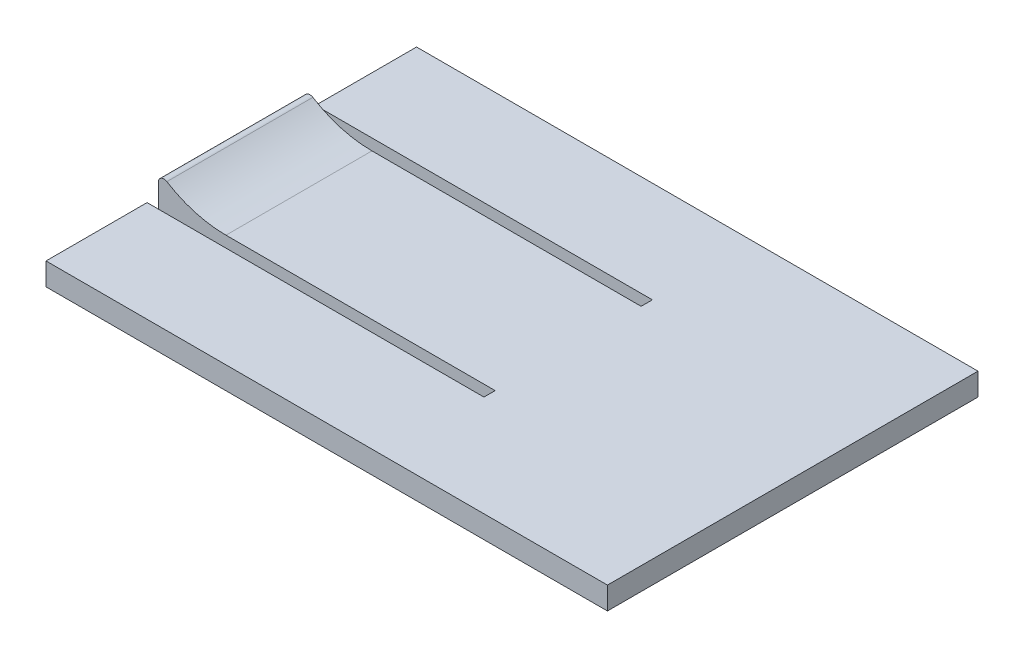
ISO-10303-21;
HEADER;
FILE_DESCRIPTION(('STEP AP214'),'2;1');
FILE_NAME('part.step','',(''),(''),'','','');
FILE_SCHEMA(('AUTOMOTIVE_DESIGN { 1 0 10303 214 1 1 1 1 }'));
ENDSEC;
DATA;
#1=APPLICATION_CONTEXT('core data for automotive mechanical design processes');
#2=APPLICATION_PROTOCOL_DEFINITION('international standard','automotive_design',2000,#1);
#3=PRODUCT_CONTEXT('',#1,'mechanical');
#4=PRODUCT('Part','Part','',(#3));
#5=PRODUCT_RELATED_PRODUCT_CATEGORY('part','',(#4));
#6=PRODUCT_DEFINITION_FORMATION('','',#4);
#7=PRODUCT_DEFINITION_CONTEXT('part definition',#1,'design');
#8=PRODUCT_DEFINITION('design','',#6,#7);
#9=PRODUCT_DEFINITION_SHAPE('','',#8);
#10=(LENGTH_UNIT() NAMED_UNIT(*) SI_UNIT(.MILLI.,.METRE.));
#11=(NAMED_UNIT(*) PLANE_ANGLE_UNIT() SI_UNIT($,.RADIAN.));
#12=(NAMED_UNIT(*) SI_UNIT($,.STERADIAN.) SOLID_ANGLE_UNIT());
#13=UNCERTAINTY_MEASURE_WITH_UNIT(LENGTH_MEASURE(1.E-05),#10,'distance_accuracy_value','');
#14=(GEOMETRIC_REPRESENTATION_CONTEXT(3) GLOBAL_UNCERTAINTY_ASSIGNED_CONTEXT((#13)) GLOBAL_UNIT_ASSIGNED_CONTEXT((#10,
#11,#12)) REPRESENTATION_CONTEXT('',''));
#15=CARTESIAN_POINT('',(0.,0.,0.));
#16=DIRECTION('',(0.,0.,1.));
#17=DIRECTION('',(1.,0.,0.));
#18=AXIS2_PLACEMENT_3D('',#15,#16,#17);
#19=CARTESIAN_POINT('',(50.,2.,33.));
#20=DIRECTION('',(0.,-1.,0.));
#21=DIRECTION('',(0.,0.,-1.));
#22=AXIS2_PLACEMENT_3D('',#19,#20,#21);
#23=PLANE('',#22);
#24=DIRECTION('',(1.,0.,0.));
#25=VECTOR('',#24,1.);
#26=CARTESIAN_POINT('',(0.,2.,10.));
#27=LINE('',#26,#25);
#28=CARTESIAN_POINT('',(6.02775637731994,2.,10.));
#29=VERTEX_POINT('',#28);
#30=CARTESIAN_POINT('',(30.,2.,10.));
#31=VERTEX_POINT('',#30);
#32=EDGE_CURVE('E142',#29,#31,#27,.T.);
#33=ORIENTED_EDGE('',*,*,#32,.F.);
#34=DIRECTION('',(0.,0.,-1.));
#35=VECTOR('',#34,1.);
#36=CARTESIAN_POINT('',(6.02775637731995,2.,23.));
#37=LINE('',#36,#35);
#38=CARTESIAN_POINT('',(6.02775637731995,2.,23.));
#39=VERTEX_POINT('',#38);
#40=EDGE_CURVE('E228',#29,#39,#37,.F.);
#41=ORIENTED_EDGE('',*,*,#40,.T.);
#42=DIRECTION('',(1.,0.,0.));
#43=VECTOR('',#42,1.);
#44=CARTESIAN_POINT('',(0.,2.,23.));
#45=LINE('',#44,#43);
#46=CARTESIAN_POINT('',(30.,2.,23.));
#47=VERTEX_POINT('',#46);
#48=EDGE_CURVE('E168',#39,#47,#45,.T.);
#49=ORIENTED_EDGE('',*,*,#48,.T.);
#50=DIRECTION('',(0.,0.,-1.));
#51=VECTOR('',#50,1.);
#52=CARTESIAN_POINT('',(30.,2.00000000000001,0.));
#53=LINE('',#52,#51);
#54=CARTESIAN_POINT('',(30.,2.,24.));
#55=VERTEX_POINT('',#54);
#56=EDGE_CURVE('E165',#55,#47,#53,.T.);
#57=ORIENTED_EDGE('',*,*,#56,.F.);
#58=DIRECTION('',(1.,0.,0.));
#59=VECTOR('',#58,1.);
#60=CARTESIAN_POINT('',(0.,2.,24.));
#61=LINE('',#60,#59);
#62=CARTESIAN_POINT('',(0.,2.,24.));
#63=VERTEX_POINT('',#62);
#64=EDGE_CURVE('E162',#63,#55,#61,.T.);
#65=ORIENTED_EDGE('',*,*,#64,.F.);
#66=DIRECTION('',(0.,0.,1.));
#67=VECTOR('',#66,1.);
#68=CARTESIAN_POINT('',(0.,2.,33.));
#69=LINE('',#68,#67);
#70=CARTESIAN_POINT('',(0.,2.,33.));
#71=VERTEX_POINT('',#70);
#72=EDGE_CURVE('E207',#63,#71,#69,.T.);
#73=ORIENTED_EDGE('',*,*,#72,.T.);
#74=DIRECTION('',(-1.,0.,0.));
#75=VECTOR('',#74,1.);
#76=CARTESIAN_POINT('',(50.,2.,33.));
#77=LINE('',#76,#75);
#78=CARTESIAN_POINT('',(50.,2.,33.));
#79=VERTEX_POINT('',#78);
#80=EDGE_CURVE('E197',#79,#71,#77,.T.);
#81=ORIENTED_EDGE('',*,*,#80,.F.);
#82=DIRECTION('',(0.,0.,1.));
#83=VECTOR('',#82,1.);
#84=CARTESIAN_POINT('',(50.,2.,33.));
#85=LINE('',#84,#83);
#86=CARTESIAN_POINT('',(50.,2.00000000000001,0.));
#87=VERTEX_POINT('',#86);
#88=EDGE_CURVE('E195',#87,#79,#85,.T.);
#89=ORIENTED_EDGE('',*,*,#88,.F.);
#90=DIRECTION('',(-1.,0.,0.));
#91=VECTOR('',#90,1.);
#92=CARTESIAN_POINT('',(50.,2.00000000000001,0.));
#93=LINE('',#92,#91);
#94=CARTESIAN_POINT('',(0.,2.00000000000001,0.));
#95=VERTEX_POINT('',#94);
#96=EDGE_CURVE('E211',#87,#95,#93,.T.);
#97=ORIENTED_EDGE('',*,*,#96,.T.);
#98=CARTESIAN_POINT('',(0.,2.00000000000001,9.));
#99=VERTEX_POINT('',#98);
#100=EDGE_CURVE('E156',#95,#99,#69,.T.);
#101=ORIENTED_EDGE('',*,*,#100,.T.);
#102=DIRECTION('',(1.,0.,0.));
#103=VECTOR('',#102,1.);
#104=CARTESIAN_POINT('',(0.,2.00000000000001,9.));
#105=LINE('',#104,#103);
#106=CARTESIAN_POINT('',(30.,2.00000000000001,9.));
#107=VERTEX_POINT('',#106);
#108=EDGE_CURVE('E135',#99,#107,#105,.T.);
#109=ORIENTED_EDGE('',*,*,#108,.T.);
#110=DIRECTION('',(0.,0.,1.));
#111=VECTOR('',#110,1.);
#112=CARTESIAN_POINT('',(30.,2.00000000000001,0.));
#113=LINE('',#112,#111);
#114=EDGE_CURVE('E146',#107,#31,#113,.T.);
#115=ORIENTED_EDGE('',*,*,#114,.T.);
#116=EDGE_LOOP('',(#33,#41,#49,#57,#65,#73,#81,#89,#97,#101,#109,#115));
#117=FACE_BOUND('',#116,.T.);
#118=ADVANCED_FACE('F33',(#117),#23,.F.);
#119=CARTESIAN_POINT('',(0.,0.,0.));
#120=DIRECTION('',(1.,0.,0.));
#121=DIRECTION('',(0.,0.,-1.));
#122=AXIS2_PLACEMENT_3D('',#119,#120,#121);
#123=PLANE('',#122);
#124=DIRECTION('',(0.,-1.,0.));
#125=VECTOR('',#124,1.);
#126=CARTESIAN_POINT('',(0.,0.,9.));
#127=LINE('',#126,#125);
#128=CARTESIAN_POINT('',(0.,0.,9.));
#129=VERTEX_POINT('',#128);
#130=EDGE_CURVE('E224',#99,#129,#127,.T.);
#131=ORIENTED_EDGE('',*,*,#130,.F.);
#132=ORIENTED_EDGE('',*,*,#100,.F.);
#133=DIRECTION('',(0.,1.,0.));
#134=VECTOR('',#133,1.);
#135=CARTESIAN_POINT('',(0.,2.00000000000001,0.));
#136=LINE('',#135,#134);
#137=CARTESIAN_POINT('',(0.,0.,0.));
#138=VERTEX_POINT('',#137);
#139=EDGE_CURVE('E204',#138,#95,#136,.T.);
#140=ORIENTED_EDGE('',*,*,#139,.F.);
#141=DIRECTION('',(0.,0.,-1.));
#142=VECTOR('',#141,1.);
#143=CARTESIAN_POINT('',(0.,0.,33.));
#144=LINE('',#143,#142);
#145=EDGE_CURVE('E200',#129,#138,#144,.T.);
#146=ORIENTED_EDGE('',*,*,#145,.F.);
#147=EDGE_LOOP('',(#131,#132,#140,#146));
#148=FACE_BOUND('',#147,.T.);
#149=ADVANCED_FACE('F258',(#148),#123,.F.);
#150=DIRECTION('',(0.,-1.,0.));
#151=VECTOR('',#150,1.);
#152=CARTESIAN_POINT('',(0.,0.,23.));
#153=LINE('',#152,#151);
#154=CARTESIAN_POINT('',(0.,3.07285547148481,23.));
#155=VERTEX_POINT('',#154);
#156=CARTESIAN_POINT('',(0.,0.,23.));
#157=VERTEX_POINT('',#156);
#158=EDGE_CURVE('E219',#155,#157,#153,.T.);
#159=ORIENTED_EDGE('',*,*,#158,.F.);
#160=DIRECTION('',(0.,0.,1.));
#161=VECTOR('',#160,1.);
#162=CARTESIAN_POINT('',(0.,3.07285547148482,0.));
#163=LINE('',#162,#161);
#164=CARTESIAN_POINT('',(0.,3.07285547148481,10.));
#165=VERTEX_POINT('',#164);
#166=EDGE_CURVE('E41',#155,#165,#163,.F.);
#167=ORIENTED_EDGE('',*,*,#166,.T.);
#168=DIRECTION('',(0.,-1.,0.));
#169=VECTOR('',#168,1.);
#170=CARTESIAN_POINT('',(0.,0.,10.));
#171=LINE('',#170,#169);
#172=CARTESIAN_POINT('',(0.,0.,10.));
#173=VERTEX_POINT('',#172);
#174=EDGE_CURVE('E226',#165,#173,#171,.T.);
#175=ORIENTED_EDGE('',*,*,#174,.T.);
#176=EDGE_CURVE('E205',#157,#173,#144,.T.);
#177=ORIENTED_EDGE('',*,*,#176,.F.);
#178=EDGE_LOOP('',(#159,#167,#175,#177));
#179=FACE_BOUND('',#178,.T.);
#180=ADVANCED_FACE('F263',(#179),#123,.F.);
#181=CARTESIAN_POINT('',(50.,2.,33.));
#182=DIRECTION('',(0.,0.,-1.));
#183=DIRECTION('',(-1.,0.,0.));
#184=AXIS2_PLACEMENT_3D('',#181,#182,#183);
#185=PLANE('',#184);
#186=DIRECTION('',(0.,-1.,0.));
#187=VECTOR('',#186,1.);
#188=CARTESIAN_POINT('',(0.,2.,33.));
#189=LINE('',#188,#187);
#190=CARTESIAN_POINT('',(0.,0.,33.));
#191=VERTEX_POINT('',#190);
#192=EDGE_CURVE('E187',#71,#191,#189,.T.);
#193=ORIENTED_EDGE('',*,*,#192,.T.);
#194=DIRECTION('',(-1.,0.,0.));
#195=VECTOR('',#194,1.);
#196=CARTESIAN_POINT('',(50.,0.,33.));
#197=LINE('',#196,#195);
#198=CARTESIAN_POINT('',(50.,0.,33.));
#199=VERTEX_POINT('',#198);
#200=EDGE_CURVE('E216',#199,#191,#197,.T.);
#201=ORIENTED_EDGE('',*,*,#200,.F.);
#202=DIRECTION('',(0.,-1.,0.));
#203=VECTOR('',#202,1.);
#204=CARTESIAN_POINT('',(50.,2.,33.));
#205=LINE('',#204,#203);
#206=EDGE_CURVE('E188',#79,#199,#205,.T.);
#207=ORIENTED_EDGE('',*,*,#206,.F.);
#208=ORIENTED_EDGE('',*,*,#80,.T.);
#209=EDGE_LOOP('',(#193,#201,#207,#208));
#210=FACE_BOUND('',#209,.T.);
#211=ADVANCED_FACE('F277',(#210),#185,.F.);
#212=CARTESIAN_POINT('',(50.,0.,33.));
#213=DIRECTION('',(0.,1.,0.));
#214=DIRECTION('',(0.,0.,1.));
#215=AXIS2_PLACEMENT_3D('',#212,#213,#214);
#216=PLANE('',#215);
#217=ORIENTED_EDGE('',*,*,#176,.T.);
#218=DIRECTION('',(1.,0.,0.));
#219=VECTOR('',#218,1.);
#220=CARTESIAN_POINT('',(50.,0.,10.));
#221=LINE('',#220,#219);
#222=CARTESIAN_POINT('',(30.,0.,10.));
#223=VERTEX_POINT('',#222);
#224=EDGE_CURVE('E179',#173,#223,#221,.T.);
#225=ORIENTED_EDGE('',*,*,#224,.T.);
#226=DIRECTION('',(0.,0.,1.));
#227=VECTOR('',#226,1.);
#228=CARTESIAN_POINT('',(30.,0.,33.));
#229=LINE('',#228,#227);
#230=CARTESIAN_POINT('',(30.,0.,9.));
#231=VERTEX_POINT('',#230);
#232=EDGE_CURVE('E185',#231,#223,#229,.T.);
#233=ORIENTED_EDGE('',*,*,#232,.F.);
#234=DIRECTION('',(1.,0.,0.));
#235=VECTOR('',#234,1.);
#236=CARTESIAN_POINT('',(50.,0.,9.));
#237=LINE('',#236,#235);
#238=EDGE_CURVE('E138',#129,#231,#237,.T.);
#239=ORIENTED_EDGE('',*,*,#238,.F.);
#240=ORIENTED_EDGE('',*,*,#145,.T.);
#241=DIRECTION('',(-1.,0.,0.));
#242=VECTOR('',#241,1.);
#243=CARTESIAN_POINT('',(50.,0.,0.));
#244=LINE('',#243,#242);
#245=CARTESIAN_POINT('',(50.,0.,0.));
#246=VERTEX_POINT('',#245);
#247=EDGE_CURVE('E213',#246,#138,#244,.T.);
#248=ORIENTED_EDGE('',*,*,#247,.F.);
#249=DIRECTION('',(0.,0.,-1.));
#250=VECTOR('',#249,1.);
#251=CARTESIAN_POINT('',(50.,0.,33.));
#252=LINE('',#251,#250);
#253=EDGE_CURVE('E191',#199,#246,#252,.T.);
#254=ORIENTED_EDGE('',*,*,#253,.F.);
#255=ORIENTED_EDGE('',*,*,#200,.T.);
#256=CARTESIAN_POINT('',(0.,0.,24.));
#257=VERTEX_POINT('',#256);
#258=EDGE_CURVE('E201',#191,#257,#144,.T.);
#259=ORIENTED_EDGE('',*,*,#258,.T.);
#260=DIRECTION('',(1.,0.,0.));
#261=VECTOR('',#260,1.);
#262=CARTESIAN_POINT('',(50.,0.,24.));
#263=LINE('',#262,#261);
#264=CARTESIAN_POINT('',(30.,0.,24.));
#265=VERTEX_POINT('',#264);
#266=EDGE_CURVE('E175',#257,#265,#263,.T.);
#267=ORIENTED_EDGE('',*,*,#266,.T.);
#268=DIRECTION('',(0.,0.,-1.));
#269=VECTOR('',#268,1.);
#270=CARTESIAN_POINT('',(30.,0.,33.));
#271=LINE('',#270,#269);
#272=CARTESIAN_POINT('',(30.,0.,23.));
#273=VERTEX_POINT('',#272);
#274=EDGE_CURVE('E182',#265,#273,#271,.T.);
#275=ORIENTED_EDGE('',*,*,#274,.T.);
#276=DIRECTION('',(1.,0.,0.));
#277=VECTOR('',#276,1.);
#278=CARTESIAN_POINT('',(50.,0.,23.));
#279=LINE('',#278,#277);
#280=EDGE_CURVE('E160',#157,#273,#279,.T.);
#281=ORIENTED_EDGE('',*,*,#280,.F.);
#282=EDGE_LOOP('',(#217,#225,#233,#239,#240,#248,#254,#255,#259,#267,#275,#281));
#283=FACE_BOUND('',#282,.T.);
#284=ADVANCED_FACE('F273',(#283),#216,.F.);
#285=CARTESIAN_POINT('',(50.,2.00000000000001,0.));
#286=DIRECTION('',(0.,0.,1.));
#287=DIRECTION('',(0.,-1.,0.));
#288=AXIS2_PLACEMENT_3D('',#285,#286,#287);
#289=PLANE('',#288);
#290=ORIENTED_EDGE('',*,*,#139,.T.);
#291=ORIENTED_EDGE('',*,*,#96,.F.);
#292=DIRECTION('',(0.,1.,0.));
#293=VECTOR('',#292,1.);
#294=CARTESIAN_POINT('',(50.,2.00000000000001,0.));
#295=LINE('',#294,#293);
#296=EDGE_CURVE('E193',#246,#87,#295,.T.);
#297=ORIENTED_EDGE('',*,*,#296,.F.);
#298=ORIENTED_EDGE('',*,*,#247,.T.);
#299=EDGE_LOOP('',(#290,#291,#297,#298));
#300=FACE_BOUND('',#299,.T.);
#301=ADVANCED_FACE('F269',(#300),#289,.F.);
#302=CARTESIAN_POINT('',(50.,0.,0.));
#303=DIRECTION('',(1.,0.,0.));
#304=DIRECTION('',(0.,0.,-1.));
#305=AXIS2_PLACEMENT_3D('',#302,#303,#304);
#306=PLANE('',#305);
#307=ORIENTED_EDGE('',*,*,#206,.T.);
#308=ORIENTED_EDGE('',*,*,#253,.T.);
#309=ORIENTED_EDGE('',*,*,#296,.T.);
#310=ORIENTED_EDGE('',*,*,#88,.T.);
#311=EDGE_LOOP('',(#307,#308,#309,#310));
#312=FACE_BOUND('',#311,.T.);
#313=ADVANCED_FACE('F272',(#312),#306,.T.);
#314=ORIENTED_EDGE('',*,*,#72,.F.);
#315=DIRECTION('',(0.,-1.,0.));
#316=VECTOR('',#315,1.);
#317=CARTESIAN_POINT('',(0.,0.,24.));
#318=LINE('',#317,#316);
#319=EDGE_CURVE('E221',#63,#257,#318,.T.);
#320=ORIENTED_EDGE('',*,*,#319,.T.);
#321=ORIENTED_EDGE('',*,*,#258,.F.);
#322=ORIENTED_EDGE('',*,*,#192,.F.);
#323=EDGE_LOOP('',(#314,#320,#321,#322));
#324=FACE_BOUND('',#323,.T.);
#325=ADVANCED_FACE('F266',(#324),#123,.F.);
#326=CARTESIAN_POINT('',(30.,-48.,0.));
#327=DIRECTION('',(1.,0.,0.));
#328=DIRECTION('',(0.,0.,-1.));
#329=AXIS2_PLACEMENT_3D('',#326,#327,#328);
#330=PLANE('',#329);
#331=DIRECTION('',(0.,1.,0.));
#332=VECTOR('',#331,1.);
#333=CARTESIAN_POINT('',(30.,-48.,24.));
#334=LINE('',#333,#332);
#335=EDGE_CURVE('E170',#265,#55,#334,.T.);
#336=ORIENTED_EDGE('',*,*,#335,.T.);
#337=ORIENTED_EDGE('',*,*,#56,.T.);
#338=DIRECTION('',(0.,1.,0.));
#339=VECTOR('',#338,1.);
#340=CARTESIAN_POINT('',(30.,-48.,23.));
#341=LINE('',#340,#339);
#342=EDGE_CURVE('E151',#273,#47,#341,.T.);
#343=ORIENTED_EDGE('',*,*,#342,.F.);
#344=ORIENTED_EDGE('',*,*,#274,.F.);
#345=EDGE_LOOP('',(#336,#337,#343,#344));
#346=FACE_BOUND('',#345,.T.);
#347=ADVANCED_FACE('F302',(#346),#330,.F.);
#348=CARTESIAN_POINT('',(0.,-48.,24.));
#349=DIRECTION('',(0.,0.,1.));
#350=DIRECTION('',(0.,-1.,0.));
#351=AXIS2_PLACEMENT_3D('',#348,#349,#350);
#352=PLANE('',#351);
#353=ORIENTED_EDGE('',*,*,#319,.F.);
#354=ORIENTED_EDGE('',*,*,#64,.T.);
#355=ORIENTED_EDGE('',*,*,#335,.F.);
#356=ORIENTED_EDGE('',*,*,#266,.F.);
#357=EDGE_LOOP('',(#353,#354,#355,#356));
#358=FACE_BOUND('',#357,.T.);
#359=ADVANCED_FACE('F298',(#358),#352,.F.);
#360=CARTESIAN_POINT('',(0.,-48.,23.));
#361=DIRECTION('',(0.,0.,1.));
#362=DIRECTION('',(0.,-1.,0.));
#363=AXIS2_PLACEMENT_3D('',#360,#361,#362);
#364=PLANE('',#363);
#365=CARTESIAN_POINT('',(6.02775637731995,12.,23.));
#366=DIRECTION('',(0.,0.,1.));
#367=DIRECTION('',(0.,-1.,0.));
#368=AXIS2_PLACEMENT_3D('',#365,#366,#367);
#369=CIRCLE('',#368,10.);
#370=CARTESIAN_POINT('',(0.763226494158097,3.49795759189029,23.));
#371=VERTEX_POINT('',#370);
#372=EDGE_CURVE('E232',#39,#371,#369,.F.);
#373=ORIENTED_EDGE('',*,*,#372,.T.);
#374=CARTESIAN_POINT('',(0.500000000000005,3.07285547148481,23.));
#375=DIRECTION('',(0.,0.,1.));
#376=DIRECTION('',(0.,-1.,0.));
#377=AXIS2_PLACEMENT_3D('',#374,#375,#376);
#378=CIRCLE('',#377,0.5);
#379=EDGE_CURVE('E55',#371,#155,#378,.T.);
#380=ORIENTED_EDGE('',*,*,#379,.T.);
#381=ORIENTED_EDGE('',*,*,#158,.T.);
#382=ORIENTED_EDGE('',*,*,#280,.T.);
#383=ORIENTED_EDGE('',*,*,#342,.T.);
#384=ORIENTED_EDGE('',*,*,#48,.F.);
#385=EDGE_LOOP('',(#373,#380,#381,#382,#383,#384));
#386=FACE_BOUND('',#385,.T.);
#387=ADVANCED_FACE('F246',(#386),#364,.T.);
#388=CARTESIAN_POINT('',(30.,-48.,0.));
#389=DIRECTION('',(-1.,0.,0.));
#390=DIRECTION('',(0.,0.,1.));
#391=AXIS2_PLACEMENT_3D('',#388,#389,#390);
#392=PLANE('',#391);
#393=ORIENTED_EDGE('',*,*,#232,.T.);
#394=DIRECTION('',(0.,1.,0.));
#395=VECTOR('',#394,1.);
#396=CARTESIAN_POINT('',(30.,-48.,9.99999999999999));
#397=LINE('',#396,#395);
#398=EDGE_CURVE('E141',#223,#31,#397,.T.);
#399=ORIENTED_EDGE('',*,*,#398,.T.);
#400=ORIENTED_EDGE('',*,*,#114,.F.);
#401=DIRECTION('',(0.,1.,0.));
#402=VECTOR('',#401,1.);
#403=CARTESIAN_POINT('',(30.,-48.,8.99999999999999));
#404=LINE('',#403,#402);
#405=EDGE_CURVE('E131',#231,#107,#404,.T.);
#406=ORIENTED_EDGE('',*,*,#405,.F.);
#407=EDGE_LOOP('',(#393,#399,#400,#406));
#408=FACE_BOUND('',#407,.T.);
#409=ADVANCED_FACE('F147',(#408),#392,.T.);
#410=CARTESIAN_POINT('',(0.,-48.,9.99999999999999));
#411=DIRECTION('',(0.,0.,1.));
#412=DIRECTION('',(0.,-1.,0.));
#413=AXIS2_PLACEMENT_3D('',#410,#411,#412);
#414=PLANE('',#413);
#415=ORIENTED_EDGE('',*,*,#174,.F.);
#416=CARTESIAN_POINT('',(0.500000000000001,3.07285547148481,10.));
#417=DIRECTION('',(0.,0.,1.));
#418=DIRECTION('',(0.,-1.,0.));
#419=AXIS2_PLACEMENT_3D('',#416,#417,#418);
#420=CIRCLE('',#419,0.5);
#421=CARTESIAN_POINT('',(0.763226494158093,3.4979575918903,10.));
#422=VERTEX_POINT('',#421);
#423=EDGE_CURVE('E11',#165,#422,#420,.F.);
#424=ORIENTED_EDGE('',*,*,#423,.T.);
#425=CARTESIAN_POINT('',(6.02775637731994,12.,10.));
#426=DIRECTION('',(0.,0.,1.));
#427=DIRECTION('',(0.,-1.,0.));
#428=AXIS2_PLACEMENT_3D('',#425,#426,#427);
#429=CIRCLE('',#428,10.);
#430=EDGE_CURVE('E230',#422,#29,#429,.T.);
#431=ORIENTED_EDGE('',*,*,#430,.T.);
#432=ORIENTED_EDGE('',*,*,#32,.T.);
#433=ORIENTED_EDGE('',*,*,#398,.F.);
#434=ORIENTED_EDGE('',*,*,#224,.F.);
#435=EDGE_LOOP('',(#415,#424,#431,#432,#433,#434));
#436=FACE_BOUND('',#435,.T.);
#437=ADVANCED_FACE('F251',(#436),#414,.F.);
#438=CARTESIAN_POINT('',(0.,-48.,8.99999999999999));
#439=DIRECTION('',(0.,0.,1.));
#440=DIRECTION('',(0.,-1.,0.));
#441=AXIS2_PLACEMENT_3D('',#438,#439,#440);
#442=PLANE('',#441);
#443=ORIENTED_EDGE('',*,*,#238,.T.);
#444=ORIENTED_EDGE('',*,*,#405,.T.);
#445=ORIENTED_EDGE('',*,*,#108,.F.);
#446=ORIENTED_EDGE('',*,*,#130,.T.);
#447=EDGE_LOOP('',(#443,#444,#445,#446));
#448=FACE_BOUND('',#447,.T.);
#449=ADVANCED_FACE('F133',(#448),#442,.T.);
#450=CARTESIAN_POINT('',(6.02775637731994,12.,6.39444872453601));
#451=DIRECTION('',(0.,0.,1.));
#452=DIRECTION('',(1.,0.,0.));
#453=AXIS2_PLACEMENT_3D('',#450,#451,#452);
#454=CYLINDRICAL_SURFACE('',#453,10.);
#455=ORIENTED_EDGE('',*,*,#430,.F.);
#456=DIRECTION('',(0.,0.,1.));
#457=VECTOR('',#456,1.);
#458=CARTESIAN_POINT('',(0.763226494158092,3.4979575918903,6.39444872453601));
#459=LINE('',#458,#457);
#460=EDGE_CURVE('E234',#422,#371,#459,.T.);
#461=ORIENTED_EDGE('',*,*,#460,.T.);
#462=ORIENTED_EDGE('',*,*,#372,.F.);
#463=ORIENTED_EDGE('',*,*,#40,.F.);
#464=EDGE_LOOP('',(#455,#461,#462,#463));
#465=FACE_BOUND('',#464,.T.);
#466=ADVANCED_FACE('F241',(#465),#454,.F.);
#467=CARTESIAN_POINT('',(0.5,3.07285547148481,6.39444872453601));
#468=DIRECTION('',(0.,0.,1.));
#469=DIRECTION('',(1.,0.,0.));
#470=AXIS2_PLACEMENT_3D('',#467,#468,#469);
#471=CYLINDRICAL_SURFACE('',#470,0.5);
#472=ORIENTED_EDGE('',*,*,#423,.F.);
#473=ORIENTED_EDGE('',*,*,#166,.F.);
#474=ORIENTED_EDGE('',*,*,#379,.F.);
#475=ORIENTED_EDGE('',*,*,#460,.F.);
#476=EDGE_LOOP('',(#472,#473,#474,#475));
#477=FACE_BOUND('',#476,.T.);
#478=ADVANCED_FACE('F35',(#477),#471,.T.);
#479=CLOSED_SHELL('',(#118,#149,#180,#211,#284,#301,#313,#325,#347,#359,#387,#409,#437,#449,
#466,#478));
#480=MANIFOLD_SOLID_BREP('B2',#479);
#481=ADVANCED_BREP_SHAPE_REPRESENTATION('',(#18,#480),#14);
#482=SHAPE_DEFINITION_REPRESENTATION(#9,#481);
ENDSEC;
END-ISO-10303-21;
